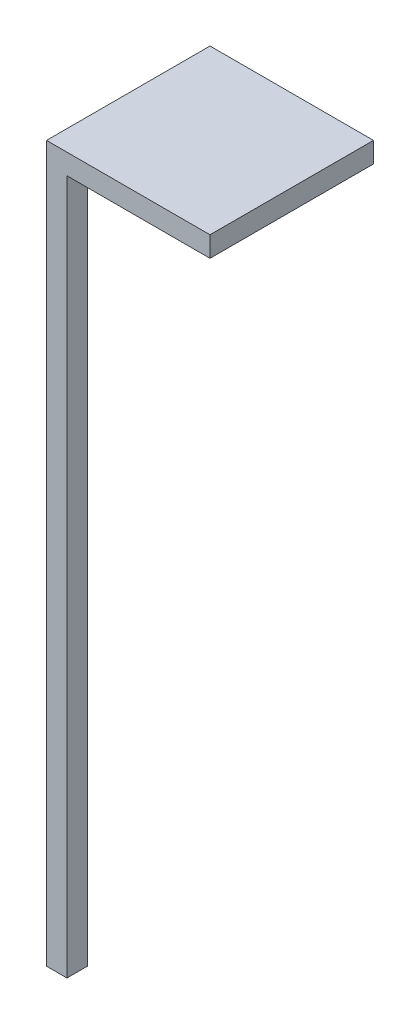
ISO-10303-21;
HEADER;
FILE_DESCRIPTION(('STEP AP214'),'2;1');
FILE_NAME('part.step','',(''),(''),'','','');
FILE_SCHEMA(('AUTOMOTIVE_DESIGN { 1 0 10303 214 1 1 1 1 }'));
ENDSEC;
DATA;
#1=APPLICATION_CONTEXT('core data for automotive mechanical design processes');
#2=APPLICATION_PROTOCOL_DEFINITION('international standard','automotive_design',2000,#1);
#3=PRODUCT_CONTEXT('',#1,'mechanical');
#4=PRODUCT('Part','Part','',(#3));
#5=PRODUCT_RELATED_PRODUCT_CATEGORY('part','',(#4));
#6=PRODUCT_DEFINITION_FORMATION('','',#4);
#7=PRODUCT_DEFINITION_CONTEXT('part definition',#1,'design');
#8=PRODUCT_DEFINITION('design','',#6,#7);
#9=PRODUCT_DEFINITION_SHAPE('','',#8);
#10=(LENGTH_UNIT() NAMED_UNIT(*) SI_UNIT(.MILLI.,.METRE.));
#11=(NAMED_UNIT(*) PLANE_ANGLE_UNIT() SI_UNIT($,.RADIAN.));
#12=(NAMED_UNIT(*) SI_UNIT($,.STERADIAN.) SOLID_ANGLE_UNIT());
#13=UNCERTAINTY_MEASURE_WITH_UNIT(LENGTH_MEASURE(1.E-05),#10,'distance_accuracy_value','');
#14=(GEOMETRIC_REPRESENTATION_CONTEXT(3) GLOBAL_UNCERTAINTY_ASSIGNED_CONTEXT((#13)) GLOBAL_UNIT_ASSIGNED_CONTEXT((#10,
#11,#12)) REPRESENTATION_CONTEXT('',''));
#15=CARTESIAN_POINT('',(0.,0.,0.));
#16=DIRECTION('',(0.,0.,1.));
#17=DIRECTION('',(1.,0.,0.));
#18=AXIS2_PLACEMENT_3D('',#15,#16,#17);
#19=CARTESIAN_POINT('',(0.,340.,0.));
#20=DIRECTION('',(1.,0.,0.));
#21=DIRECTION('',(0.,0.,-1.));
#22=AXIS2_PLACEMENT_3D('',#19,#20,#21);
#23=PLANE('',#22);
#24=DIRECTION('',(0.,0.,1.));
#25=VECTOR('',#24,1.);
#26=CARTESIAN_POINT('',(0.,0.,0.));
#27=LINE('',#26,#25);
#28=CARTESIAN_POINT('',(0.,0.,-10.));
#29=VERTEX_POINT('',#28);
#30=CARTESIAN_POINT('',(0.,0.,0.));
#31=VERTEX_POINT('',#30);
#32=EDGE_CURVE('E81',#29,#31,#27,.T.);
#33=ORIENTED_EDGE('',*,*,#32,.T.);
#34=DIRECTION('',(0.,-1.,0.));
#35=VECTOR('',#34,1.);
#36=CARTESIAN_POINT('',(0.,340.,0.));
#37=LINE('',#36,#35);
#38=CARTESIAN_POINT('',(0.,350.,0.));
#39=VERTEX_POINT('',#38);
#40=EDGE_CURVE('E11',#39,#31,#37,.T.);
#41=ORIENTED_EDGE('',*,*,#40,.F.);
#42=DIRECTION('',(0.,0.,1.));
#43=VECTOR('',#42,1.);
#44=CARTESIAN_POINT('',(0.,350.,0.));
#45=LINE('',#44,#43);
#46=CARTESIAN_POINT('',(0.,350.,-80.));
#47=VERTEX_POINT('',#46);
#48=EDGE_CURVE('E125',#47,#39,#45,.T.);
#49=ORIENTED_EDGE('',*,*,#48,.F.);
#50=DIRECTION('',(0.,-1.,0.));
#51=VECTOR('',#50,1.);
#52=CARTESIAN_POINT('',(0.,350.,-80.));
#53=LINE('',#52,#51);
#54=CARTESIAN_POINT('',(0.,340.,-80.));
#55=VERTEX_POINT('',#54);
#56=EDGE_CURVE('E155',#47,#55,#53,.T.);
#57=ORIENTED_EDGE('',*,*,#56,.T.);
#58=DIRECTION('',(0.,0.,1.));
#59=VECTOR('',#58,1.);
#60=CARTESIAN_POINT('',(0.,340.,0.));
#61=LINE('',#60,#59);
#62=CARTESIAN_POINT('',(0.,340.,-10.));
#63=VERTEX_POINT('',#62);
#64=EDGE_CURVE('E84',#55,#63,#61,.T.);
#65=ORIENTED_EDGE('',*,*,#64,.T.);
#66=DIRECTION('',(0.,-1.,0.));
#67=VECTOR('',#66,1.);
#68=CARTESIAN_POINT('',(0.,340.,-10.));
#69=LINE('',#68,#67);
#70=EDGE_CURVE('E71',#63,#29,#69,.T.);
#71=ORIENTED_EDGE('',*,*,#70,.T.);
#72=EDGE_LOOP('',(#33,#41,#49,#57,#65,#71));
#73=FACE_BOUND('',#72,.T.);
#74=ADVANCED_FACE('F30',(#73),#23,.F.);
#75=CARTESIAN_POINT('',(0.,340.,0.));
#76=DIRECTION('',(0.,0.,-1.));
#77=DIRECTION('',(-1.,0.,0.));
#78=AXIS2_PLACEMENT_3D('',#75,#76,#77);
#79=PLANE('',#78);
#80=DIRECTION('',(1.,0.,0.));
#81=VECTOR('',#80,1.);
#82=CARTESIAN_POINT('',(0.,0.,0.));
#83=LINE('',#82,#81);
#84=CARTESIAN_POINT('',(10.,0.,0.));
#85=VERTEX_POINT('',#84);
#86=EDGE_CURVE('E88',#31,#85,#83,.T.);
#87=ORIENTED_EDGE('',*,*,#86,.T.);
#88=DIRECTION('',(0.,-1.,0.));
#89=VECTOR('',#88,1.);
#90=CARTESIAN_POINT('',(10.,340.,0.));
#91=LINE('',#90,#89);
#92=CARTESIAN_POINT('',(10.,340.,0.));
#93=VERTEX_POINT('',#92);
#94=EDGE_CURVE('E39',#93,#85,#91,.T.);
#95=ORIENTED_EDGE('',*,*,#94,.F.);
#96=DIRECTION('',(1.,0.,0.));
#97=VECTOR('',#96,1.);
#98=CARTESIAN_POINT('',(0.,340.,0.));
#99=LINE('',#98,#97);
#100=CARTESIAN_POINT('',(80.,340.,0.));
#101=VERTEX_POINT('',#100);
#102=EDGE_CURVE('E112',#93,#101,#99,.T.);
#103=ORIENTED_EDGE('',*,*,#102,.T.);
#104=DIRECTION('',(0.,-1.,0.));
#105=VECTOR('',#104,1.);
#106=CARTESIAN_POINT('',(80.,350.,0.));
#107=LINE('',#106,#105);
#108=CARTESIAN_POINT('',(80.,350.,0.));
#109=VERTEX_POINT('',#108);
#110=EDGE_CURVE('E89',#109,#101,#107,.T.);
#111=ORIENTED_EDGE('',*,*,#110,.F.);
#112=DIRECTION('',(1.,0.,0.));
#113=VECTOR('',#112,1.);
#114=CARTESIAN_POINT('',(0.,350.,0.));
#115=LINE('',#114,#113);
#116=EDGE_CURVE('E121',#39,#109,#115,.T.);
#117=ORIENTED_EDGE('',*,*,#116,.F.);
#118=ORIENTED_EDGE('',*,*,#40,.T.);
#119=EDGE_LOOP('',(#87,#95,#103,#111,#117,#118));
#120=FACE_BOUND('',#119,.T.);
#121=ADVANCED_FACE('F115',(#120),#79,.F.);
#122=CARTESIAN_POINT('',(10.,340.,0.));
#123=DIRECTION('',(-1.,0.,0.));
#124=DIRECTION('',(0.,0.,1.));
#125=AXIS2_PLACEMENT_3D('',#122,#123,#124);
#126=PLANE('',#125);
#127=DIRECTION('',(0.,0.,-1.));
#128=VECTOR('',#127,1.);
#129=CARTESIAN_POINT('',(10.,0.,0.));
#130=LINE('',#129,#128);
#131=CARTESIAN_POINT('',(10.,0.,-10.));
#132=VERTEX_POINT('',#131);
#133=EDGE_CURVE('E63',#85,#132,#130,.T.);
#134=ORIENTED_EDGE('',*,*,#133,.T.);
#135=DIRECTION('',(0.,-1.,0.));
#136=VECTOR('',#135,1.);
#137=CARTESIAN_POINT('',(10.,340.,-10.));
#138=LINE('',#137,#136);
#139=CARTESIAN_POINT('',(10.,340.,-10.));
#140=VERTEX_POINT('',#139);
#141=EDGE_CURVE('E48',#140,#132,#138,.T.);
#142=ORIENTED_EDGE('',*,*,#141,.F.);
#143=DIRECTION('',(0.,0.,-1.));
#144=VECTOR('',#143,1.);
#145=CARTESIAN_POINT('',(10.,340.,0.));
#146=LINE('',#145,#144);
#147=EDGE_CURVE('E75',#93,#140,#146,.T.);
#148=ORIENTED_EDGE('',*,*,#147,.F.);
#149=ORIENTED_EDGE('',*,*,#94,.T.);
#150=EDGE_LOOP('',(#134,#142,#148,#149));
#151=FACE_BOUND('',#150,.T.);
#152=ADVANCED_FACE('F113',(#151),#126,.F.);
#153=CARTESIAN_POINT('',(0.,340.,-10.));
#154=DIRECTION('',(0.,0.,1.));
#155=DIRECTION('',(1.,0.,0.));
#156=AXIS2_PLACEMENT_3D('',#153,#154,#155);
#157=PLANE('',#156);
#158=DIRECTION('',(-1.,0.,0.));
#159=VECTOR('',#158,1.);
#160=CARTESIAN_POINT('',(0.,0.,-10.));
#161=LINE('',#160,#159);
#162=EDGE_CURVE('E68',#132,#29,#161,.T.);
#163=ORIENTED_EDGE('',*,*,#162,.T.);
#164=ORIENTED_EDGE('',*,*,#70,.F.);
#165=DIRECTION('',(-1.,0.,0.));
#166=VECTOR('',#165,1.);
#167=CARTESIAN_POINT('',(0.,340.,-10.));
#168=LINE('',#167,#166);
#169=EDGE_CURVE('E85',#140,#63,#168,.T.);
#170=ORIENTED_EDGE('',*,*,#169,.F.);
#171=ORIENTED_EDGE('',*,*,#141,.T.);
#172=EDGE_LOOP('',(#163,#164,#170,#171));
#173=FACE_BOUND('',#172,.T.);
#174=ADVANCED_FACE('F70',(#173),#157,.F.);
#175=CARTESIAN_POINT('',(0.,0.,-10.));
#176=DIRECTION('',(0.,-1.,0.));
#177=DIRECTION('',(0.,0.,-1.));
#178=AXIS2_PLACEMENT_3D('',#175,#176,#177);
#179=PLANE('',#178);
#180=ORIENTED_EDGE('',*,*,#32,.F.);
#181=ORIENTED_EDGE('',*,*,#162,.F.);
#182=ORIENTED_EDGE('',*,*,#133,.F.);
#183=ORIENTED_EDGE('',*,*,#86,.F.);
#184=EDGE_LOOP('',(#180,#181,#182,#183));
#185=FACE_BOUND('',#184,.T.);
#186=ADVANCED_FACE('F87',(#185),#179,.T.);
#187=CARTESIAN_POINT('',(80.,350.,0.));
#188=DIRECTION('',(-1.,0.,0.));
#189=DIRECTION('',(0.,0.,1.));
#190=AXIS2_PLACEMENT_3D('',#187,#188,#189);
#191=PLANE('',#190);
#192=DIRECTION('',(0.,0.,-1.));
#193=VECTOR('',#192,1.);
#194=CARTESIAN_POINT('',(80.,340.,0.));
#195=LINE('',#194,#193);
#196=CARTESIAN_POINT('',(80.,340.,-80.));
#197=VERTEX_POINT('',#196);
#198=EDGE_CURVE('E143',#101,#197,#195,.T.);
#199=ORIENTED_EDGE('',*,*,#198,.T.);
#200=DIRECTION('',(0.,-1.,0.));
#201=VECTOR('',#200,1.);
#202=CARTESIAN_POINT('',(80.,350.,-80.));
#203=LINE('',#202,#201);
#204=CARTESIAN_POINT('',(80.,350.,-80.));
#205=VERTEX_POINT('',#204);
#206=EDGE_CURVE('E93',#205,#197,#203,.T.);
#207=ORIENTED_EDGE('',*,*,#206,.F.);
#208=DIRECTION('',(0.,0.,-1.));
#209=VECTOR('',#208,1.);
#210=CARTESIAN_POINT('',(80.,350.,0.));
#211=LINE('',#210,#209);
#212=EDGE_CURVE('E167',#109,#205,#211,.T.);
#213=ORIENTED_EDGE('',*,*,#212,.F.);
#214=ORIENTED_EDGE('',*,*,#110,.T.);
#215=EDGE_LOOP('',(#199,#207,#213,#214));
#216=FACE_BOUND('',#215,.T.);
#217=ADVANCED_FACE('F145',(#216),#191,.F.);
#218=CARTESIAN_POINT('',(0.,350.,-80.));
#219=DIRECTION('',(0.,0.,1.));
#220=DIRECTION('',(1.,0.,0.));
#221=AXIS2_PLACEMENT_3D('',#218,#219,#220);
#222=PLANE('',#221);
#223=DIRECTION('',(-1.,0.,0.));
#224=VECTOR('',#223,1.);
#225=CARTESIAN_POINT('',(0.,340.,-80.));
#226=LINE('',#225,#224);
#227=EDGE_CURVE('E149',#197,#55,#226,.T.);
#228=ORIENTED_EDGE('',*,*,#227,.T.);
#229=ORIENTED_EDGE('',*,*,#56,.F.);
#230=DIRECTION('',(-1.,0.,0.));
#231=VECTOR('',#230,1.);
#232=CARTESIAN_POINT('',(0.,350.,-80.));
#233=LINE('',#232,#231);
#234=EDGE_CURVE('E154',#205,#47,#233,.T.);
#235=ORIENTED_EDGE('',*,*,#234,.F.);
#236=ORIENTED_EDGE('',*,*,#206,.T.);
#237=EDGE_LOOP('',(#228,#229,#235,#236));
#238=FACE_BOUND('',#237,.T.);
#239=ADVANCED_FACE('F152',(#238),#222,.F.);
#240=CARTESIAN_POINT('',(0.,350.,-80.));
#241=DIRECTION('',(0.,-1.,0.));
#242=DIRECTION('',(0.,0.,-1.));
#243=AXIS2_PLACEMENT_3D('',#240,#241,#242);
#244=PLANE('',#243);
#245=ORIENTED_EDGE('',*,*,#48,.T.);
#246=ORIENTED_EDGE('',*,*,#116,.T.);
#247=ORIENTED_EDGE('',*,*,#212,.T.);
#248=ORIENTED_EDGE('',*,*,#234,.T.);
#249=EDGE_LOOP('',(#245,#246,#247,#248));
#250=FACE_BOUND('',#249,.T.);
#251=ADVANCED_FACE('F170',(#250),#244,.F.);
#252=CARTESIAN_POINT('',(0.,340.,-80.));
#253=DIRECTION('',(0.,-1.,0.));
#254=DIRECTION('',(0.,0.,-1.));
#255=AXIS2_PLACEMENT_3D('',#252,#253,#254);
#256=PLANE('',#255);
#257=ORIENTED_EDGE('',*,*,#102,.F.);
#258=ORIENTED_EDGE('',*,*,#147,.T.);
#259=ORIENTED_EDGE('',*,*,#169,.T.);
#260=ORIENTED_EDGE('',*,*,#64,.F.);
#261=ORIENTED_EDGE('',*,*,#227,.F.);
#262=ORIENTED_EDGE('',*,*,#198,.F.);
#263=EDGE_LOOP('',(#257,#258,#259,#260,#261,#262));
#264=FACE_BOUND('',#263,.T.);
#265=ADVANCED_FACE('F109',(#264),#256,.T.);
#266=CLOSED_SHELL('',(#74,#121,#152,#174,#186,#217,#239,#251,#265));
#267=MANIFOLD_SOLID_BREP('B2',#266);
#268=ADVANCED_BREP_SHAPE_REPRESENTATION('',(#18,#267),#14);
#269=SHAPE_DEFINITION_REPRESENTATION(#9,#268);
ENDSEC;
END-ISO-10303-21;
